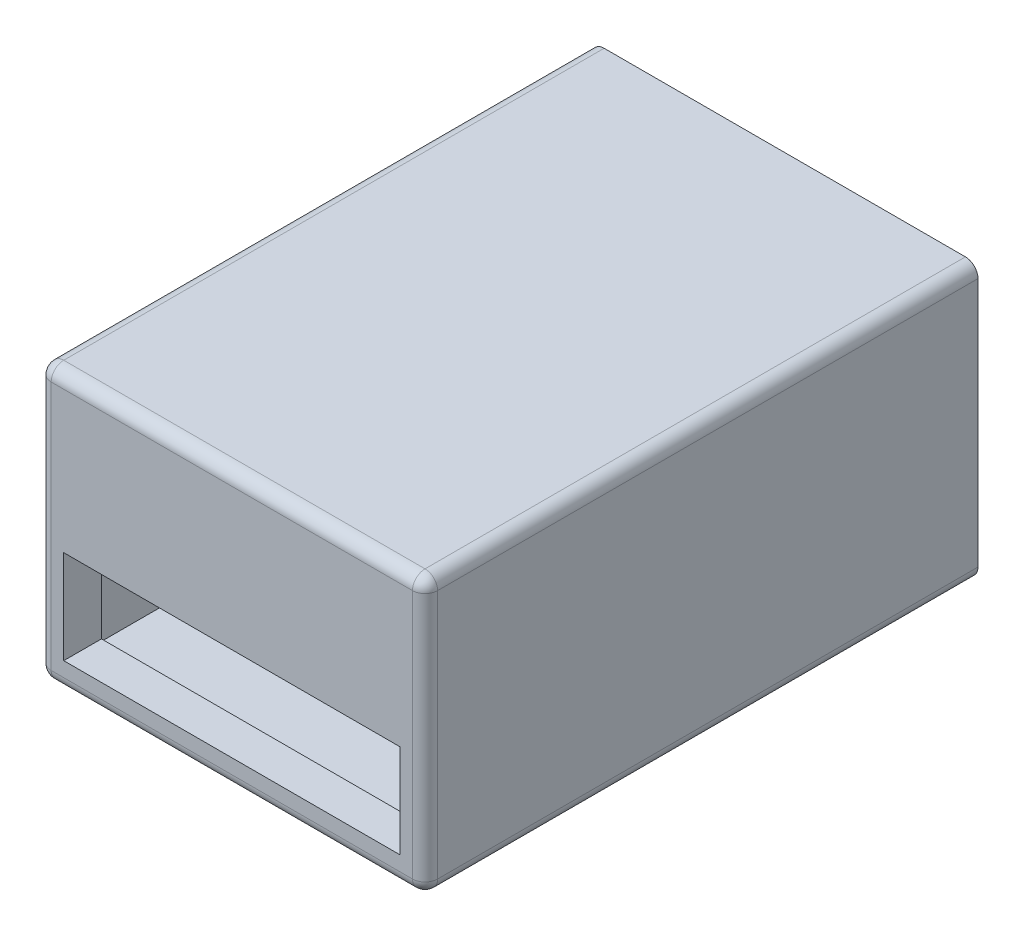
ISO-10303-21;
HEADER;
FILE_DESCRIPTION(('STEP AP214'),'2;1');
FILE_NAME('part.step','',(''),(''),'','','');
FILE_SCHEMA(('AUTOMOTIVE_DESIGN { 1 0 10303 214 1 1 1 1 }'));
ENDSEC;
DATA;
#1=APPLICATION_CONTEXT('core data for automotive mechanical design processes');
#2=APPLICATION_PROTOCOL_DEFINITION('international standard','automotive_design',2000,#1);
#3=PRODUCT_CONTEXT('',#1,'mechanical');
#4=PRODUCT('Part','Part','',(#3));
#5=PRODUCT_RELATED_PRODUCT_CATEGORY('part','',(#4));
#6=PRODUCT_DEFINITION_FORMATION('','',#4);
#7=PRODUCT_DEFINITION_CONTEXT('part definition',#1,'design');
#8=PRODUCT_DEFINITION('design','',#6,#7);
#9=PRODUCT_DEFINITION_SHAPE('','',#8);
#10=(LENGTH_UNIT() NAMED_UNIT(*) SI_UNIT(.MILLI.,.METRE.));
#11=(NAMED_UNIT(*) PLANE_ANGLE_UNIT() SI_UNIT($,.RADIAN.));
#12=(NAMED_UNIT(*) SI_UNIT($,.STERADIAN.) SOLID_ANGLE_UNIT());
#13=UNCERTAINTY_MEASURE_WITH_UNIT(LENGTH_MEASURE(1.E-05),#10,'distance_accuracy_value','');
#14=(GEOMETRIC_REPRESENTATION_CONTEXT(3) GLOBAL_UNCERTAINTY_ASSIGNED_CONTEXT((#13)) GLOBAL_UNIT_ASSIGNED_CONTEXT((#10,
#11,#12)) REPRESENTATION_CONTEXT('',''));
#15=CARTESIAN_POINT('',(0.,0.,0.));
#16=DIRECTION('',(0.,0.,1.));
#17=DIRECTION('',(1.,0.,0.));
#18=AXIS2_PLACEMENT_3D('',#15,#16,#17);
#19=CARTESIAN_POINT('',(0.,0.,88.));
#20=DIRECTION('',(0.,0.,1.));
#21=DIRECTION('',(1.,0.,0.));
#22=AXIS2_PLACEMENT_3D('',#19,#20,#21);
#23=PLANE('',#22);
#24=DIRECTION('',(-1.,0.,0.));
#25=VECTOR('',#24,1.);
#26=CARTESIAN_POINT('',(-31.6005025125628,32.626256281407,88.));
#27=LINE('',#26,#25);
#28=CARTESIAN_POINT('',(27.8994974874372,32.626256281407,88.));
#29=VERTEX_POINT('',#28);
#30=CARTESIAN_POINT('',(-29.6005025125628,32.626256281407,88.));
#31=VERTEX_POINT('',#30);
#32=EDGE_CURVE('E269',#29,#31,#27,.T.);
#33=ORIENTED_EDGE('',*,*,#32,.T.);
#34=DIRECTION('',(0.,-1.,0.));
#35=VECTOR('',#34,1.);
#36=CARTESIAN_POINT('',(-29.6005025125628,-9.12374371859297,88.));
#37=LINE('',#36,#35);
#38=CARTESIAN_POINT('',(-29.6005025125628,-7.12374371859297,88.));
#39=VERTEX_POINT('',#38);
#40=EDGE_CURVE('E275',#31,#39,#37,.T.);
#41=ORIENTED_EDGE('',*,*,#40,.T.);
#42=DIRECTION('',(1.,0.,0.));
#43=VECTOR('',#42,1.);
#44=CARTESIAN_POINT('',(29.8994974874372,-7.12374371859297,88.));
#45=LINE('',#44,#43);
#46=CARTESIAN_POINT('',(27.8994974874372,-7.12374371859297,88.));
#47=VERTEX_POINT('',#46);
#48=EDGE_CURVE('E273',#39,#47,#45,.T.);
#49=ORIENTED_EDGE('',*,*,#48,.T.);
#50=DIRECTION('',(0.,1.,0.));
#51=VECTOR('',#50,1.);
#52=CARTESIAN_POINT('',(27.8994974874372,34.626256281407,88.));
#53=LINE('',#52,#51);
#54=EDGE_CURVE('E271',#47,#29,#53,.T.);
#55=ORIENTED_EDGE('',*,*,#54,.T.);
#56=EDGE_LOOP('',(#33,#41,#49,#55));
#57=FACE_BOUND('',#56,.T.);
#58=DIRECTION('',(1.,0.,0.));
#59=VECTOR('',#58,1.);
#60=CARTESIAN_POINT('',(-27.6005025125628,-4.78162550383576,88.));
#61=LINE('',#60,#59);
#62=CARTESIAN_POINT('',(-27.6005025125628,-4.78162550383576,88.));
#63=VERTEX_POINT('',#62);
#64=CARTESIAN_POINT('',(25.8994974874372,-4.78162550383576,88.));
#65=VERTEX_POINT('',#64);
#66=EDGE_CURVE('E217',#63,#65,#61,.T.);
#67=ORIENTED_EDGE('',*,*,#66,.F.);
#68=DIRECTION('',(0.,1.,0.));
#69=VECTOR('',#68,1.);
#70=CARTESIAN_POINT('',(-27.6005025125628,-4.78162550383576,88.));
#71=LINE('',#70,#69);
#72=CARTESIAN_POINT('',(-27.6005025125628,10.1082239368324,88.));
#73=VERTEX_POINT('',#72);
#74=EDGE_CURVE('E208',#63,#73,#71,.T.);
#75=ORIENTED_EDGE('',*,*,#74,.T.);
#76=DIRECTION('',(1.,0.,0.));
#77=VECTOR('',#76,1.);
#78=CARTESIAN_POINT('',(-27.6005025125628,10.1082239368324,88.));
#79=LINE('',#78,#77);
#80=CARTESIAN_POINT('',(25.8994974874372,10.1082239368324,88.));
#81=VERTEX_POINT('',#80);
#82=EDGE_CURVE('E211',#73,#81,#79,.T.);
#83=ORIENTED_EDGE('',*,*,#82,.T.);
#84=DIRECTION('',(0.,-1.,0.));
#85=VECTOR('',#84,1.);
#86=CARTESIAN_POINT('',(25.8994974874372,10.1082239368324,88.));
#87=LINE('',#86,#85);
#88=EDGE_CURVE('E214',#81,#65,#87,.T.);
#89=ORIENTED_EDGE('',*,*,#88,.T.);
#90=EDGE_LOOP('',(#67,#75,#83,#89));
#91=FACE_BOUND('',#90,.T.);
#92=ADVANCED_FACE('F32',(#57,#91),#23,.T.);
#93=CARTESIAN_POINT('',(0.,0.,0.));
#94=DIRECTION('',(0.,0.,1.));
#95=DIRECTION('',(1.,0.,0.));
#96=AXIS2_PLACEMENT_3D('',#93,#94,#95);
#97=PLANE('',#96);
#98=DIRECTION('',(0.,1.,0.));
#99=VECTOR('',#98,1.);
#100=CARTESIAN_POINT('',(-29.6005025125628,32.626256281407,0.));
#101=LINE('',#100,#99);
#102=CARTESIAN_POINT('',(-29.6005025125628,-7.12374371859297,0.));
#103=VERTEX_POINT('',#102);
#104=CARTESIAN_POINT('',(-29.6005025125628,32.626256281407,0.));
#105=VERTEX_POINT('',#104);
#106=EDGE_CURVE('E192',#103,#105,#101,.T.);
#107=ORIENTED_EDGE('',*,*,#106,.F.);
#108=DIRECTION('',(-1.,0.,0.));
#109=VECTOR('',#108,1.);
#110=CARTESIAN_POINT('',(27.9021455883418,-7.12374371859297,0.));
#111=LINE('',#110,#109);
#112=CARTESIAN_POINT('',(27.9021455883418,-7.12374371859297,0.));
#113=VERTEX_POINT('',#112);
#114=EDGE_CURVE('E163',#113,#103,#111,.T.);
#115=ORIENTED_EDGE('',*,*,#114,.F.);
#116=DIRECTION('',(0.,-1.,0.));
#117=VECTOR('',#116,1.);
#118=CARTESIAN_POINT('',(27.9021455883418,32.626256281407,0.));
#119=LINE('',#118,#117);
#120=CARTESIAN_POINT('',(27.9021455883418,32.626256281407,0.));
#121=VERTEX_POINT('',#120);
#122=EDGE_CURVE('E180',#121,#113,#119,.T.);
#123=ORIENTED_EDGE('',*,*,#122,.F.);
#124=DIRECTION('',(1.,0.,0.));
#125=VECTOR('',#124,1.);
#126=CARTESIAN_POINT('',(27.9021455883418,32.626256281407,0.));
#127=LINE('',#126,#125);
#128=EDGE_CURVE('E183',#105,#121,#127,.T.);
#129=ORIENTED_EDGE('',*,*,#128,.F.);
#130=EDGE_LOOP('',(#107,#115,#123,#129));
#131=FACE_BOUND('',#130,.T.);
#132=DIRECTION('',(0.,-1.,0.));
#133=VECTOR('',#132,1.);
#134=CARTESIAN_POINT('',(-31.6005025125628,34.626256281407,0.));
#135=LINE('',#134,#133);
#136=CARTESIAN_POINT('',(-31.6005025125628,32.626256281407,0.));
#137=VERTEX_POINT('',#136);
#138=CARTESIAN_POINT('',(-31.6005025125628,-7.12374371859296,0.));
#139=VERTEX_POINT('',#138);
#140=EDGE_CURVE('E228',#137,#139,#135,.T.);
#141=ORIENTED_EDGE('',*,*,#140,.F.);
#142=CARTESIAN_POINT('',(-29.6005025125628,32.626256281407,0.));
#143=DIRECTION('',(0.,0.,1.));
#144=DIRECTION('',(1.,0.,0.));
#145=AXIS2_PLACEMENT_3D('',#142,#143,#144);
#146=CIRCLE('',#145,2.);
#147=CARTESIAN_POINT('',(-29.6005025125628,34.626256281407,0.));
#148=VERTEX_POINT('',#147);
#149=EDGE_CURVE('E255',#137,#148,#146,.F.);
#150=ORIENTED_EDGE('',*,*,#149,.T.);
#151=DIRECTION('',(-1.,0.,0.));
#152=VECTOR('',#151,1.);
#153=CARTESIAN_POINT('',(-31.6005025125628,34.626256281407,0.));
#154=LINE('',#153,#152);
#155=CARTESIAN_POINT('',(27.8994974874372,34.626256281407,0.));
#156=VERTEX_POINT('',#155);
#157=EDGE_CURVE('E236',#156,#148,#154,.T.);
#158=ORIENTED_EDGE('',*,*,#157,.F.);
#159=CARTESIAN_POINT('',(27.8994974874372,32.626256281407,0.));
#160=DIRECTION('',(0.,0.,1.));
#161=DIRECTION('',(1.,0.,0.));
#162=AXIS2_PLACEMENT_3D('',#159,#160,#161);
#163=CIRCLE('',#162,2.);
#164=CARTESIAN_POINT('',(29.8994974874372,32.626256281407,0.));
#165=VERTEX_POINT('',#164);
#166=EDGE_CURVE('E249',#156,#165,#163,.F.);
#167=ORIENTED_EDGE('',*,*,#166,.T.);
#168=DIRECTION('',(0.,1.,0.));
#169=VECTOR('',#168,1.);
#170=CARTESIAN_POINT('',(29.8994974874372,34.626256281407,0.));
#171=LINE('',#170,#169);
#172=CARTESIAN_POINT('',(29.8994974874372,-7.12374371859296,0.));
#173=VERTEX_POINT('',#172);
#174=EDGE_CURVE('E234',#173,#165,#171,.T.);
#175=ORIENTED_EDGE('',*,*,#174,.F.);
#176=CARTESIAN_POINT('',(27.8994974874372,-7.12374371859296,0.));
#177=DIRECTION('',(0.,0.,1.));
#178=DIRECTION('',(1.,0.,0.));
#179=AXIS2_PLACEMENT_3D('',#176,#177,#178);
#180=CIRCLE('',#179,2.);
#181=CARTESIAN_POINT('',(27.8994974874372,-9.12374371859297,0.));
#182=VERTEX_POINT('',#181);
#183=EDGE_CURVE('E251',#173,#182,#180,.F.);
#184=ORIENTED_EDGE('',*,*,#183,.T.);
#185=DIRECTION('',(1.,0.,0.));
#186=VECTOR('',#185,1.);
#187=CARTESIAN_POINT('',(-31.6005025125628,-9.12374371859297,0.));
#188=LINE('',#187,#186);
#189=CARTESIAN_POINT('',(-29.6005025125628,-9.12374371859297,0.));
#190=VERTEX_POINT('',#189);
#191=EDGE_CURVE('E231',#190,#182,#188,.T.);
#192=ORIENTED_EDGE('',*,*,#191,.F.);
#193=CARTESIAN_POINT('',(-29.6005025125628,-7.12374371859297,0.));
#194=DIRECTION('',(0.,0.,1.));
#195=DIRECTION('',(1.,0.,0.));
#196=AXIS2_PLACEMENT_3D('',#193,#194,#195);
#197=CIRCLE('',#196,2.);
#198=EDGE_CURVE('E253',#190,#139,#197,.F.);
#199=ORIENTED_EDGE('',*,*,#198,.T.);
#200=EDGE_LOOP('',(#141,#150,#158,#167,#175,#184,#192,#199));
#201=FACE_BOUND('',#200,.T.);
#202=ADVANCED_FACE('F338',(#131,#201),#97,.F.);
#203=CARTESIAN_POINT('',(-31.6005025125628,34.626256281407,88.));
#204=DIRECTION('',(1.,0.,0.));
#205=DIRECTION('',(0.,1.,0.));
#206=AXIS2_PLACEMENT_3D('',#203,#204,#205);
#207=PLANE('',#206);
#208=DIRECTION('',(0.,-1.,0.));
#209=VECTOR('',#208,1.);
#210=CARTESIAN_POINT('',(-31.6005025125628,34.626256281407,86.));
#211=LINE('',#210,#209);
#212=CARTESIAN_POINT('',(-31.6005025125628,-7.12374371859297,86.));
#213=VERTEX_POINT('',#212);
#214=CARTESIAN_POINT('',(-31.6005025125628,32.626256281407,86.));
#215=VERTEX_POINT('',#214);
#216=EDGE_CURVE('E242',#213,#215,#211,.F.);
#217=ORIENTED_EDGE('',*,*,#216,.T.);
#218=DIRECTION('',(0.,0.,-1.));
#219=VECTOR('',#218,1.);
#220=CARTESIAN_POINT('',(-31.6005025125628,32.626256281407,88.));
#221=LINE('',#220,#219);
#222=EDGE_CURVE('E246',#215,#137,#221,.T.);
#223=ORIENTED_EDGE('',*,*,#222,.T.);
#224=ORIENTED_EDGE('',*,*,#140,.T.);
#225=DIRECTION('',(0.,0.,-1.));
#226=VECTOR('',#225,1.);
#227=CARTESIAN_POINT('',(-31.6005025125628,-7.12374371859296,88.));
#228=LINE('',#227,#226);
#229=EDGE_CURVE('E244',#139,#213,#228,.F.);
#230=ORIENTED_EDGE('',*,*,#229,.T.);
#231=EDGE_LOOP('',(#217,#223,#224,#230));
#232=FACE_BOUND('',#231,.T.);
#233=ADVANCED_FACE('F344',(#232),#207,.F.);
#234=CARTESIAN_POINT('',(-31.6005025125628,-9.12374371859297,88.));
#235=DIRECTION('',(0.,1.,0.));
#236=DIRECTION('',(0.,0.,1.));
#237=AXIS2_PLACEMENT_3D('',#234,#235,#236);
#238=PLANE('',#237);
#239=DIRECTION('',(1.,0.,0.));
#240=VECTOR('',#239,1.);
#241=CARTESIAN_POINT('',(-31.6005025125628,-9.12374371859297,86.));
#242=LINE('',#241,#240);
#243=CARTESIAN_POINT('',(27.8994974874372,-9.12374371859297,86.));
#244=VERTEX_POINT('',#243);
#245=CARTESIAN_POINT('',(-29.6005025125628,-9.12374371859297,86.));
#246=VERTEX_POINT('',#245);
#247=EDGE_CURVE('E265',#244,#246,#242,.F.);
#248=ORIENTED_EDGE('',*,*,#247,.T.);
#249=DIRECTION('',(0.,0.,-1.));
#250=VECTOR('',#249,1.);
#251=CARTESIAN_POINT('',(-29.6005025125628,-9.12374371859297,88.));
#252=LINE('',#251,#250);
#253=EDGE_CURVE('E267',#246,#190,#252,.T.);
#254=ORIENTED_EDGE('',*,*,#253,.T.);
#255=ORIENTED_EDGE('',*,*,#191,.T.);
#256=DIRECTION('',(0.,0.,-1.));
#257=VECTOR('',#256,1.);
#258=CARTESIAN_POINT('',(27.8994974874372,-9.12374371859297,88.));
#259=LINE('',#258,#257);
#260=EDGE_CURVE('E263',#182,#244,#259,.F.);
#261=ORIENTED_EDGE('',*,*,#260,.T.);
#262=EDGE_LOOP('',(#248,#254,#255,#261));
#263=FACE_BOUND('',#262,.T.);
#264=ADVANCED_FACE('F359',(#263),#238,.F.);
#265=CARTESIAN_POINT('',(29.8994974874372,34.626256281407,88.));
#266=DIRECTION('',(-1.,0.,0.));
#267=DIRECTION('',(0.,0.,1.));
#268=AXIS2_PLACEMENT_3D('',#265,#266,#267);
#269=PLANE('',#268);
#270=DIRECTION('',(0.,1.,0.));
#271=VECTOR('',#270,1.);
#272=CARTESIAN_POINT('',(29.8994974874372,-9.12374371859297,86.));
#273=LINE('',#272,#271);
#274=CARTESIAN_POINT('',(29.8994974874372,32.626256281407,86.));
#275=VERTEX_POINT('',#274);
#276=CARTESIAN_POINT('',(29.8994974874372,-7.12374371859296,86.));
#277=VERTEX_POINT('',#276);
#278=EDGE_CURVE('E47',#275,#277,#273,.F.);
#279=ORIENTED_EDGE('',*,*,#278,.T.);
#280=DIRECTION('',(0.,0.,-1.));
#281=VECTOR('',#280,1.);
#282=CARTESIAN_POINT('',(29.8994974874372,-7.12374371859296,88.));
#283=LINE('',#282,#281);
#284=EDGE_CURVE('E280',#277,#173,#283,.T.);
#285=ORIENTED_EDGE('',*,*,#284,.T.);
#286=ORIENTED_EDGE('',*,*,#174,.T.);
#287=DIRECTION('',(0.,0.,-1.));
#288=VECTOR('',#287,1.);
#289=CARTESIAN_POINT('',(29.8994974874372,32.626256281407,88.));
#290=LINE('',#289,#288);
#291=EDGE_CURVE('E52',#165,#275,#290,.F.);
#292=ORIENTED_EDGE('',*,*,#291,.T.);
#293=EDGE_LOOP('',(#279,#285,#286,#292));
#294=FACE_BOUND('',#293,.T.);
#295=ADVANCED_FACE('F355',(#294),#269,.F.);
#296=CARTESIAN_POINT('',(-31.6005025125628,34.626256281407,88.));
#297=DIRECTION('',(0.,-1.,0.));
#298=DIRECTION('',(0.,0.,-1.));
#299=AXIS2_PLACEMENT_3D('',#296,#297,#298);
#300=PLANE('',#299);
#301=ORIENTED_EDGE('',*,*,#157,.T.);
#302=DIRECTION('',(0.,0.,-1.));
#303=VECTOR('',#302,1.);
#304=CARTESIAN_POINT('',(-29.6005025125628,34.626256281407,88.));
#305=LINE('',#304,#303);
#306=CARTESIAN_POINT('',(-29.6005025125628,34.626256281407,86.));
#307=VERTEX_POINT('',#306);
#308=EDGE_CURVE('E261',#148,#307,#305,.F.);
#309=ORIENTED_EDGE('',*,*,#308,.T.);
#310=DIRECTION('',(-1.,0.,0.));
#311=VECTOR('',#310,1.);
#312=CARTESIAN_POINT('',(29.8994974874372,34.626256281407,86.));
#313=LINE('',#312,#311);
#314=CARTESIAN_POINT('',(27.8994974874372,34.626256281407,86.));
#315=VERTEX_POINT('',#314);
#316=EDGE_CURVE('E259',#307,#315,#313,.F.);
#317=ORIENTED_EDGE('',*,*,#316,.T.);
#318=DIRECTION('',(0.,0.,-1.));
#319=VECTOR('',#318,1.);
#320=CARTESIAN_POINT('',(27.8994974874372,34.626256281407,88.));
#321=LINE('',#320,#319);
#322=EDGE_CURVE('E257',#315,#156,#321,.T.);
#323=ORIENTED_EDGE('',*,*,#322,.T.);
#324=EDGE_LOOP('',(#301,#309,#317,#323));
#325=FACE_BOUND('',#324,.T.);
#326=ADVANCED_FACE('F352',(#325),#300,.F.);
#327=CARTESIAN_POINT('',(-27.6005025125628,-4.78162550383576,-0.001000000000001));
#328=DIRECTION('',(1.,0.,0.));
#329=DIRECTION('',(0.,0.,-1.));
#330=AXIS2_PLACEMENT_3D('',#327,#328,#329);
#331=PLANE('',#330);
#332=DIRECTION('',(0.,-1.,0.));
#333=VECTOR('',#332,1.);
#334=CARTESIAN_POINT('',(-27.6005025125628,-4.78162550383576,82.));
#335=LINE('',#334,#333);
#336=CARTESIAN_POINT('',(-27.6005025125628,10.1082239368324,82.));
#337=VERTEX_POINT('',#336);
#338=CARTESIAN_POINT('',(-27.6005025125628,-4.78162550383576,82.));
#339=VERTEX_POINT('',#338);
#340=EDGE_CURVE('E206',#337,#339,#335,.T.);
#341=ORIENTED_EDGE('',*,*,#340,.F.);
#342=DIRECTION('',(0.,0.,1.));
#343=VECTOR('',#342,1.);
#344=CARTESIAN_POINT('',(-27.6005025125628,10.1082239368324,-0.001000000000001));
#345=LINE('',#344,#343);
#346=EDGE_CURVE('E226',#337,#73,#345,.T.);
#347=ORIENTED_EDGE('',*,*,#346,.T.);
#348=ORIENTED_EDGE('',*,*,#74,.F.);
#349=DIRECTION('',(0.,0.,1.));
#350=VECTOR('',#349,1.);
#351=CARTESIAN_POINT('',(-27.6005025125628,-4.78162550383576,-0.001000000000001));
#352=LINE('',#351,#350);
#353=EDGE_CURVE('E220',#339,#63,#352,.T.);
#354=ORIENTED_EDGE('',*,*,#353,.F.);
#355=EDGE_LOOP('',(#341,#347,#348,#354));
#356=FACE_BOUND('',#355,.T.);
#357=ADVANCED_FACE('F349',(#356),#331,.T.);
#358=CARTESIAN_POINT('',(-27.6005025125628,10.1082239368324,-0.001000000000001));
#359=DIRECTION('',(0.,-1.,0.));
#360=DIRECTION('',(0.,0.,-1.));
#361=AXIS2_PLACEMENT_3D('',#358,#359,#360);
#362=PLANE('',#361);
#363=DIRECTION('',(-1.,0.,0.));
#364=VECTOR('',#363,1.);
#365=CARTESIAN_POINT('',(-27.6005025125628,10.1082239368324,82.));
#366=LINE('',#365,#364);
#367=CARTESIAN_POINT('',(25.8994974874372,10.1082239368324,82.));
#368=VERTEX_POINT('',#367);
#369=EDGE_CURVE('E204',#368,#337,#366,.T.);
#370=ORIENTED_EDGE('',*,*,#369,.F.);
#371=DIRECTION('',(0.,0.,1.));
#372=VECTOR('',#371,1.);
#373=CARTESIAN_POINT('',(25.8994974874372,10.1082239368324,-0.001000000000001));
#374=LINE('',#373,#372);
#375=EDGE_CURVE('E224',#368,#81,#374,.T.);
#376=ORIENTED_EDGE('',*,*,#375,.T.);
#377=ORIENTED_EDGE('',*,*,#82,.F.);
#378=ORIENTED_EDGE('',*,*,#346,.F.);
#379=EDGE_LOOP('',(#370,#376,#377,#378));
#380=FACE_BOUND('',#379,.T.);
#381=ADVANCED_FACE('F644',(#380),#362,.T.);
#382=CARTESIAN_POINT('',(25.8994974874372,10.1082239368324,-0.001000000000001));
#383=DIRECTION('',(-1.,0.,0.));
#384=DIRECTION('',(0.,0.,1.));
#385=AXIS2_PLACEMENT_3D('',#382,#383,#384);
#386=PLANE('',#385);
#387=DIRECTION('',(0.,1.,0.));
#388=VECTOR('',#387,1.);
#389=CARTESIAN_POINT('',(25.8994974874372,10.1082239368324,82.));
#390=LINE('',#389,#388);
#391=CARTESIAN_POINT('',(25.8994974874372,-4.78162550383576,82.));
#392=VERTEX_POINT('',#391);
#393=EDGE_CURVE('E199',#392,#368,#390,.T.);
#394=ORIENTED_EDGE('',*,*,#393,.F.);
#395=DIRECTION('',(0.,0.,1.));
#396=VECTOR('',#395,1.);
#397=CARTESIAN_POINT('',(25.8994974874372,-4.78162550383576,-0.001000000000001));
#398=LINE('',#397,#396);
#399=EDGE_CURVE('E222',#392,#65,#398,.T.);
#400=ORIENTED_EDGE('',*,*,#399,.T.);
#401=ORIENTED_EDGE('',*,*,#88,.F.);
#402=ORIENTED_EDGE('',*,*,#375,.F.);
#403=EDGE_LOOP('',(#394,#400,#401,#402));
#404=FACE_BOUND('',#403,.T.);
#405=ADVANCED_FACE('F332',(#404),#386,.T.);
#406=CARTESIAN_POINT('',(-27.6005025125628,-4.78162550383576,-0.001000000000001));
#407=DIRECTION('',(0.,-1.,0.));
#408=DIRECTION('',(0.,0.,-1.));
#409=AXIS2_PLACEMENT_3D('',#406,#407,#408);
#410=PLANE('',#409);
#411=ORIENTED_EDGE('',*,*,#399,.F.);
#412=DIRECTION('',(-1.,0.,0.));
#413=VECTOR('',#412,1.);
#414=CARTESIAN_POINT('',(-27.6005025125628,-4.78162550383576,82.));
#415=LINE('',#414,#413);
#416=EDGE_CURVE('E239',#392,#339,#415,.T.);
#417=ORIENTED_EDGE('',*,*,#416,.T.);
#418=ORIENTED_EDGE('',*,*,#353,.T.);
#419=ORIENTED_EDGE('',*,*,#66,.T.);
#420=EDGE_LOOP('',(#411,#417,#418,#419));
#421=FACE_BOUND('',#420,.T.);
#422=ADVANCED_FACE('F322',(#421),#410,.F.);
#423=CARTESIAN_POINT('',(27.9021455883418,-7.12374371859297,82.));
#424=DIRECTION('',(0.,-1.,0.));
#425=DIRECTION('',(0.,0.,-1.));
#426=AXIS2_PLACEMENT_3D('',#423,#424,#425);
#427=PLANE('',#426);
#428=CARTESIAN_POINT('',(-9.85050251256282,-7.12374371859297,9.49999999999999));
#429=DIRECTION('',(0.,-1.,0.));
#430=DIRECTION('',(0.,0.,-1.));
#431=AXIS2_PLACEMENT_3D('',#428,#429,#430);
#432=CIRCLE('',#431,1.5);
#433=CARTESIAN_POINT('',(-9.85050251256282,-7.12374371859297,7.99999999999999));
#434=VERTEX_POINT('',#433);
#435=EDGE_CURVE('E11',#434,#434,#432,.F.);
#436=ORIENTED_EDGE('',*,*,#435,.F.);
#437=EDGE_LOOP('',(#436));
#438=FACE_BOUND('',#437,.T.);
#439=CARTESIAN_POINT('',(18.0021455883418,-7.12374371859297,9.40000000000001));
#440=DIRECTION('',(0.,-1.,0.));
#441=DIRECTION('',(0.,0.,-1.));
#442=AXIS2_PLACEMENT_3D('',#439,#440,#441);
#443=CIRCLE('',#442,1.5);
#444=CARTESIAN_POINT('',(18.0021455883418,-7.12374371859297,7.9));
#445=VERTEX_POINT('',#444);
#446=EDGE_CURVE('E40',#445,#445,#443,.F.);
#447=ORIENTED_EDGE('',*,*,#446,.F.);
#448=EDGE_LOOP('',(#447));
#449=FACE_BOUND('',#448,.T.);
#450=ORIENTED_EDGE('',*,*,#114,.T.);
#451=DIRECTION('',(0.,0.,-1.));
#452=VECTOR('',#451,1.);
#453=CARTESIAN_POINT('',(-29.6005025125628,-7.12374371859297,82.));
#454=LINE('',#453,#452);
#455=CARTESIAN_POINT('',(-29.6005025125628,-7.12374371859297,82.));
#456=VERTEX_POINT('',#455);
#457=EDGE_CURVE('E156',#456,#103,#454,.T.);
#458=ORIENTED_EDGE('',*,*,#457,.F.);
#459=DIRECTION('',(-1.,0.,0.));
#460=VECTOR('',#459,1.);
#461=CARTESIAN_POINT('',(27.9021455883418,-7.12374371859297,82.));
#462=LINE('',#461,#460);
#463=CARTESIAN_POINT('',(27.9021455883418,-7.12374371859297,82.));
#464=VERTEX_POINT('',#463);
#465=EDGE_CURVE('E160',#464,#456,#462,.T.);
#466=ORIENTED_EDGE('',*,*,#465,.F.);
#467=DIRECTION('',(0.,0.,-1.));
#468=VECTOR('',#467,1.);
#469=CARTESIAN_POINT('',(27.9021455883418,-7.12374371859297,82.));
#470=LINE('',#469,#468);
#471=EDGE_CURVE('E197',#464,#113,#470,.T.);
#472=ORIENTED_EDGE('',*,*,#471,.T.);
#473=EDGE_LOOP('',(#450,#458,#466,#472));
#474=FACE_BOUND('',#473,.T.);
#475=ADVANCED_FACE('F158',(#438,#449,#474),#427,.F.);
#476=CARTESIAN_POINT('',(27.9021455883418,32.626256281407,82.));
#477=DIRECTION('',(1.,0.,0.));
#478=DIRECTION('',(0.,0.,-1.));
#479=AXIS2_PLACEMENT_3D('',#476,#477,#478);
#480=PLANE('',#479);
#481=ORIENTED_EDGE('',*,*,#122,.T.);
#482=ORIENTED_EDGE('',*,*,#471,.F.);
#483=DIRECTION('',(0.,-1.,0.));
#484=VECTOR('',#483,1.);
#485=CARTESIAN_POINT('',(27.9021455883418,32.626256281407,82.));
#486=LINE('',#485,#484);
#487=CARTESIAN_POINT('',(27.9021455883418,32.626256281407,82.));
#488=VERTEX_POINT('',#487);
#489=EDGE_CURVE('E168',#488,#464,#486,.T.);
#490=ORIENTED_EDGE('',*,*,#489,.F.);
#491=DIRECTION('',(0.,0.,-1.));
#492=VECTOR('',#491,1.);
#493=CARTESIAN_POINT('',(27.9021455883418,32.626256281407,82.));
#494=LINE('',#493,#492);
#495=EDGE_CURVE('E200',#488,#121,#494,.T.);
#496=ORIENTED_EDGE('',*,*,#495,.T.);
#497=EDGE_LOOP('',(#481,#482,#490,#496));
#498=FACE_BOUND('',#497,.T.);
#499=ADVANCED_FACE('F321',(#498),#480,.F.);
#500=CARTESIAN_POINT('',(27.9021455883418,32.626256281407,82.));
#501=DIRECTION('',(0.,1.,0.));
#502=DIRECTION('',(0.,0.,1.));
#503=AXIS2_PLACEMENT_3D('',#500,#501,#502);
#504=PLANE('',#503);
#505=ORIENTED_EDGE('',*,*,#128,.T.);
#506=ORIENTED_EDGE('',*,*,#495,.F.);
#507=DIRECTION('',(1.,0.,0.));
#508=VECTOR('',#507,1.);
#509=CARTESIAN_POINT('',(27.9021455883418,32.626256281407,82.));
#510=LINE('',#509,#508);
#511=CARTESIAN_POINT('',(-29.6005025125628,32.626256281407,82.));
#512=VERTEX_POINT('',#511);
#513=EDGE_CURVE('E176',#512,#488,#510,.T.);
#514=ORIENTED_EDGE('',*,*,#513,.F.);
#515=DIRECTION('',(0.,0.,-1.));
#516=VECTOR('',#515,1.);
#517=CARTESIAN_POINT('',(-29.6005025125628,32.626256281407,82.));
#518=LINE('',#517,#516);
#519=EDGE_CURVE('E167',#512,#105,#518,.T.);
#520=ORIENTED_EDGE('',*,*,#519,.T.);
#521=EDGE_LOOP('',(#505,#506,#514,#520));
#522=FACE_BOUND('',#521,.T.);
#523=ADVANCED_FACE('F329',(#522),#504,.F.);
#524=CARTESIAN_POINT('',(-29.6005025125628,32.626256281407,82.));
#525=DIRECTION('',(-1.,0.,0.));
#526=DIRECTION('',(0.,-1.,0.));
#527=AXIS2_PLACEMENT_3D('',#524,#525,#526);
#528=PLANE('',#527);
#529=ORIENTED_EDGE('',*,*,#106,.T.);
#530=ORIENTED_EDGE('',*,*,#519,.F.);
#531=DIRECTION('',(0.,1.,0.));
#532=VECTOR('',#531,1.);
#533=CARTESIAN_POINT('',(-29.6005025125628,32.626256281407,82.));
#534=LINE('',#533,#532);
#535=EDGE_CURVE('E171',#456,#512,#534,.T.);
#536=ORIENTED_EDGE('',*,*,#535,.F.);
#537=ORIENTED_EDGE('',*,*,#457,.T.);
#538=EDGE_LOOP('',(#529,#530,#536,#537));
#539=FACE_BOUND('',#538,.T.);
#540=ADVANCED_FACE('F172',(#539),#528,.F.);
#541=CARTESIAN_POINT('',(0.,0.,82.));
#542=DIRECTION('',(0.,0.,1.));
#543=DIRECTION('',(1.,0.,0.));
#544=AXIS2_PLACEMENT_3D('',#541,#542,#543);
#545=PLANE('',#544);
#546=ORIENTED_EDGE('',*,*,#340,.T.);
#547=ORIENTED_EDGE('',*,*,#416,.F.);
#548=ORIENTED_EDGE('',*,*,#393,.T.);
#549=ORIENTED_EDGE('',*,*,#369,.T.);
#550=EDGE_LOOP('',(#546,#547,#548,#549));
#551=FACE_BOUND('',#550,.T.);
#552=ORIENTED_EDGE('',*,*,#465,.T.);
#553=ORIENTED_EDGE('',*,*,#535,.T.);
#554=ORIENTED_EDGE('',*,*,#513,.T.);
#555=ORIENTED_EDGE('',*,*,#489,.T.);
#556=EDGE_LOOP('',(#552,#553,#554,#555));
#557=FACE_BOUND('',#556,.T.);
#558=ADVANCED_FACE('F178',(#551,#557),#545,.F.);
#559=CARTESIAN_POINT('',(27.8994974874372,-7.12374371859296,88.));
#560=DIRECTION('',(0.,0.,-1.));
#561=DIRECTION('',(-1.,0.,0.));
#562=AXIS2_PLACEMENT_3D('',#559,#560,#561);
#563=CYLINDRICAL_SURFACE('',#562,2.);
#564=CARTESIAN_POINT('',(27.8994974874372,-7.12374371859297,86.));
#565=DIRECTION('',(0.,0.,1.));
#566=DIRECTION('',(1.,0.,0.));
#567=AXIS2_PLACEMENT_3D('',#564,#565,#566);
#568=CIRCLE('',#567,2.);
#569=EDGE_CURVE('E193',#244,#277,#568,.T.);
#570=ORIENTED_EDGE('',*,*,#569,.F.);
#571=ORIENTED_EDGE('',*,*,#260,.F.);
#572=ORIENTED_EDGE('',*,*,#183,.F.);
#573=ORIENTED_EDGE('',*,*,#284,.F.);
#574=EDGE_LOOP('',(#570,#571,#572,#573));
#575=FACE_BOUND('',#574,.T.);
#576=ADVANCED_FACE('F34',(#575),#563,.T.);
#577=CARTESIAN_POINT('',(27.8994974874372,-7.12374371859297,86.));
#578=DIRECTION('',(0.,0.,1.));
#579=DIRECTION('',(1.,0.,0.));
#580=AXIS2_PLACEMENT_3D('',#577,#578,#579);
#581=SPHERICAL_SURFACE('',#580,2.);
#582=CARTESIAN_POINT('',(27.8994974874372,-7.12374371859297,86.));
#583=DIRECTION('',(1.,0.,0.));
#584=DIRECTION('',(0.,0.,-1.));
#585=AXIS2_PLACEMENT_3D('',#582,#583,#584);
#586=CIRCLE('',#585,2.);
#587=EDGE_CURVE('E308',#244,#47,#586,.F.);
#588=ORIENTED_EDGE('',*,*,#587,.F.);
#589=ORIENTED_EDGE('',*,*,#569,.T.);
#590=CARTESIAN_POINT('',(27.8994974874372,-7.12374371859296,86.));
#591=DIRECTION('',(0.,-1.,0.));
#592=DIRECTION('',(0.,0.,-1.));
#593=AXIS2_PLACEMENT_3D('',#590,#591,#592);
#594=CIRCLE('',#593,2.);
#595=EDGE_CURVE('E311',#47,#277,#594,.F.);
#596=ORIENTED_EDGE('',*,*,#595,.F.);
#597=EDGE_LOOP('',(#588,#589,#596));
#598=FACE_BOUND('',#597,.T.);
#599=ADVANCED_FACE('F404',(#598),#581,.T.);
#600=CARTESIAN_POINT('',(27.8994974874372,32.626256281407,88.));
#601=DIRECTION('',(0.,0.,-1.));
#602=DIRECTION('',(-1.,0.,0.));
#603=AXIS2_PLACEMENT_3D('',#600,#601,#602);
#604=CYLINDRICAL_SURFACE('',#603,2.);
#605=ORIENTED_EDGE('',*,*,#166,.F.);
#606=ORIENTED_EDGE('',*,*,#322,.F.);
#607=CARTESIAN_POINT('',(27.8994974874372,32.626256281407,86.));
#608=DIRECTION('',(0.,0.,1.));
#609=DIRECTION('',(1.,0.,0.));
#610=AXIS2_PLACEMENT_3D('',#607,#608,#609);
#611=CIRCLE('',#610,2.);
#612=EDGE_CURVE('E305',#275,#315,#611,.T.);
#613=ORIENTED_EDGE('',*,*,#612,.F.);
#614=ORIENTED_EDGE('',*,*,#291,.F.);
#615=EDGE_LOOP('',(#605,#606,#613,#614));
#616=FACE_BOUND('',#615,.T.);
#617=ADVANCED_FACE('F401',(#616),#604,.T.);
#618=CARTESIAN_POINT('',(27.8994974874372,0.,86.));
#619=DIRECTION('',(0.,-1.,0.));
#620=DIRECTION('',(0.,0.,-1.));
#621=AXIS2_PLACEMENT_3D('',#618,#619,#620);
#622=CYLINDRICAL_SURFACE('',#621,2.);
#623=ORIENTED_EDGE('',*,*,#595,.T.);
#624=ORIENTED_EDGE('',*,*,#278,.F.);
#625=CARTESIAN_POINT('',(27.8994974874372,32.626256281407,86.));
#626=DIRECTION('',(0.,1.,0.));
#627=DIRECTION('',(0.,0.,1.));
#628=AXIS2_PLACEMENT_3D('',#625,#626,#627);
#629=CIRCLE('',#628,2.);
#630=EDGE_CURVE('E302',#29,#275,#629,.T.);
#631=ORIENTED_EDGE('',*,*,#630,.F.);
#632=ORIENTED_EDGE('',*,*,#54,.F.);
#633=EDGE_LOOP('',(#623,#624,#631,#632));
#634=FACE_BOUND('',#633,.T.);
#635=ADVANCED_FACE('F397',(#634),#622,.T.);
#636=CARTESIAN_POINT('',(0.,-7.12374371859297,86.));
#637=DIRECTION('',(-1.,0.,0.));
#638=DIRECTION('',(0.,0.,1.));
#639=AXIS2_PLACEMENT_3D('',#636,#637,#638);
#640=CYLINDRICAL_SURFACE('',#639,2.);
#641=ORIENTED_EDGE('',*,*,#587,.T.);
#642=ORIENTED_EDGE('',*,*,#48,.F.);
#643=CARTESIAN_POINT('',(-29.6005025125628,-7.12374371859297,86.));
#644=DIRECTION('',(-1.,0.,0.));
#645=DIRECTION('',(0.,0.,1.));
#646=AXIS2_PLACEMENT_3D('',#643,#644,#645);
#647=CIRCLE('',#646,2.);
#648=EDGE_CURVE('E299',#246,#39,#647,.T.);
#649=ORIENTED_EDGE('',*,*,#648,.F.);
#650=ORIENTED_EDGE('',*,*,#247,.F.);
#651=EDGE_LOOP('',(#641,#642,#649,#650));
#652=FACE_BOUND('',#651,.T.);
#653=ADVANCED_FACE('F393',(#652),#640,.T.);
#654=CARTESIAN_POINT('',(-29.6005025125628,-7.12374371859297,88.));
#655=DIRECTION('',(0.,0.,-1.));
#656=DIRECTION('',(-1.,0.,0.));
#657=AXIS2_PLACEMENT_3D('',#654,#655,#656);
#658=CYLINDRICAL_SURFACE('',#657,2.);
#659=ORIENTED_EDGE('',*,*,#198,.F.);
#660=ORIENTED_EDGE('',*,*,#253,.F.);
#661=CARTESIAN_POINT('',(-29.6005025125628,-7.12374371859297,86.));
#662=DIRECTION('',(0.,0.,1.));
#663=DIRECTION('',(1.,0.,0.));
#664=AXIS2_PLACEMENT_3D('',#661,#662,#663);
#665=CIRCLE('',#664,2.);
#666=EDGE_CURVE('E296',#213,#246,#665,.T.);
#667=ORIENTED_EDGE('',*,*,#666,.F.);
#668=ORIENTED_EDGE('',*,*,#229,.F.);
#669=EDGE_LOOP('',(#659,#660,#667,#668));
#670=FACE_BOUND('',#669,.T.);
#671=ADVANCED_FACE('F389',(#670),#658,.T.);
#672=CARTESIAN_POINT('',(27.8994974874372,32.626256281407,86.));
#673=DIRECTION('',(0.,0.,1.));
#674=DIRECTION('',(1.,0.,0.));
#675=AXIS2_PLACEMENT_3D('',#672,#673,#674);
#676=SPHERICAL_SURFACE('',#675,2.);
#677=ORIENTED_EDGE('',*,*,#630,.T.);
#678=ORIENTED_EDGE('',*,*,#612,.T.);
#679=CARTESIAN_POINT('',(27.8994974874372,32.626256281407,86.));
#680=DIRECTION('',(1.,0.,0.));
#681=DIRECTION('',(0.,0.,-1.));
#682=AXIS2_PLACEMENT_3D('',#679,#680,#681);
#683=CIRCLE('',#682,2.);
#684=EDGE_CURVE('E293',#29,#315,#683,.F.);
#685=ORIENTED_EDGE('',*,*,#684,.F.);
#686=EDGE_LOOP('',(#677,#678,#685));
#687=FACE_BOUND('',#686,.T.);
#688=ADVANCED_FACE('F385',(#687),#676,.T.);
#689=CARTESIAN_POINT('',(-29.6005025125628,-7.12374371859297,86.));
#690=DIRECTION('',(0.,0.,1.));
#691=DIRECTION('',(1.,0.,0.));
#692=AXIS2_PLACEMENT_3D('',#689,#690,#691);
#693=SPHERICAL_SURFACE('',#692,2.);
#694=ORIENTED_EDGE('',*,*,#666,.T.);
#695=ORIENTED_EDGE('',*,*,#648,.T.);
#696=CARTESIAN_POINT('',(-29.6005025125628,-7.12374371859297,86.));
#697=DIRECTION('',(0.,-1.,0.));
#698=DIRECTION('',(0.,0.,-1.));
#699=AXIS2_PLACEMENT_3D('',#696,#697,#698);
#700=CIRCLE('',#699,2.);
#701=EDGE_CURVE('E291',#213,#39,#700,.F.);
#702=ORIENTED_EDGE('',*,*,#701,.F.);
#703=EDGE_LOOP('',(#694,#695,#702));
#704=FACE_BOUND('',#703,.T.);
#705=ADVANCED_FACE('F381',(#704),#693,.T.);
#706=CARTESIAN_POINT('',(0.,32.626256281407,86.));
#707=DIRECTION('',(1.,0.,0.));
#708=DIRECTION('',(0.,0.,-1.));
#709=AXIS2_PLACEMENT_3D('',#706,#707,#708);
#710=CYLINDRICAL_SURFACE('',#709,2.);
#711=ORIENTED_EDGE('',*,*,#684,.T.);
#712=ORIENTED_EDGE('',*,*,#316,.F.);
#713=CARTESIAN_POINT('',(-29.6005025125628,32.626256281407,86.));
#714=DIRECTION('',(-1.,0.,0.));
#715=DIRECTION('',(0.,0.,1.));
#716=AXIS2_PLACEMENT_3D('',#713,#714,#715);
#717=CIRCLE('',#716,2.);
#718=EDGE_CURVE('E288',#31,#307,#717,.T.);
#719=ORIENTED_EDGE('',*,*,#718,.F.);
#720=ORIENTED_EDGE('',*,*,#32,.F.);
#721=EDGE_LOOP('',(#711,#712,#719,#720));
#722=FACE_BOUND('',#721,.T.);
#723=ADVANCED_FACE('F377',(#722),#710,.T.);
#724=CARTESIAN_POINT('',(-29.6005025125628,0.,86.));
#725=DIRECTION('',(0.,1.,0.));
#726=DIRECTION('',(-1.,0.,0.));
#727=AXIS2_PLACEMENT_3D('',#724,#725,#726);
#728=CYLINDRICAL_SURFACE('',#727,2.);
#729=ORIENTED_EDGE('',*,*,#701,.T.);
#730=ORIENTED_EDGE('',*,*,#40,.F.);
#731=CARTESIAN_POINT('',(-29.6005025125628,32.626256281407,86.));
#732=DIRECTION('',(0.,1.,0.));
#733=DIRECTION('',(0.,0.,1.));
#734=AXIS2_PLACEMENT_3D('',#731,#732,#733);
#735=CIRCLE('',#734,2.);
#736=EDGE_CURVE('E285',#215,#31,#735,.T.);
#737=ORIENTED_EDGE('',*,*,#736,.F.);
#738=ORIENTED_EDGE('',*,*,#216,.F.);
#739=EDGE_LOOP('',(#729,#730,#737,#738));
#740=FACE_BOUND('',#739,.T.);
#741=ADVANCED_FACE('F373',(#740),#728,.T.);
#742=CARTESIAN_POINT('',(-29.6005025125628,32.626256281407,86.));
#743=DIRECTION('',(0.,0.,1.));
#744=DIRECTION('',(1.,0.,0.));
#745=AXIS2_PLACEMENT_3D('',#742,#743,#744);
#746=SPHERICAL_SURFACE('',#745,2.);
#747=ORIENTED_EDGE('',*,*,#736,.T.);
#748=ORIENTED_EDGE('',*,*,#718,.T.);
#749=CARTESIAN_POINT('',(-29.6005025125628,32.626256281407,86.));
#750=DIRECTION('',(0.,0.,1.));
#751=DIRECTION('',(1.,0.,0.));
#752=AXIS2_PLACEMENT_3D('',#749,#750,#751);
#753=CIRCLE('',#752,2.);
#754=EDGE_CURVE('E282',#215,#307,#753,.F.);
#755=ORIENTED_EDGE('',*,*,#754,.F.);
#756=EDGE_LOOP('',(#747,#748,#755));
#757=FACE_BOUND('',#756,.T.);
#758=ADVANCED_FACE('F369',(#757),#746,.T.);
#759=CARTESIAN_POINT('',(-29.6005025125628,32.626256281407,88.));
#760=DIRECTION('',(0.,0.,-1.));
#761=DIRECTION('',(-1.,0.,0.));
#762=AXIS2_PLACEMENT_3D('',#759,#760,#761);
#763=CYLINDRICAL_SURFACE('',#762,2.);
#764=ORIENTED_EDGE('',*,*,#754,.T.);
#765=ORIENTED_EDGE('',*,*,#308,.F.);
#766=ORIENTED_EDGE('',*,*,#149,.F.);
#767=ORIENTED_EDGE('',*,*,#222,.F.);
#768=EDGE_LOOP('',(#764,#765,#766,#767));
#769=FACE_BOUND('',#768,.T.);
#770=ADVANCED_FACE('F366',(#769),#763,.T.);
#771=CARTESIAN_POINT('',(18.0021455883418,-1.92374371859297,9.40000000000001));
#772=DIRECTION('',(0.,-1.,0.));
#773=DIRECTION('',(0.,0.,-1.));
#774=AXIS2_PLACEMENT_3D('',#771,#772,#773);
#775=CYLINDRICAL_SURFACE('',#774,1.5);
#776=CARTESIAN_POINT('',(18.0021455883418,-1.92374371859297,9.40000000000001));
#777=DIRECTION('',(0.,1.,0.));
#778=DIRECTION('',(0.,0.,1.));
#779=AXIS2_PLACEMENT_3D('',#776,#777,#778);
#780=CIRCLE('',#779,1.5);
#781=CARTESIAN_POINT('',(18.0021455883418,-1.92374371859297,10.9));
#782=VERTEX_POINT('',#781);
#783=EDGE_CURVE('E186',#782,#782,#780,.T.);
#784=ORIENTED_EDGE('',*,*,#783,.F.);
#785=EDGE_LOOP('',(#784));
#786=FACE_BOUND('',#785,.T.);
#787=ORIENTED_EDGE('',*,*,#446,.T.);
#788=EDGE_LOOP('',(#787));
#789=FACE_BOUND('',#788,.T.);
#790=ADVANCED_FACE('F318',(#786,#789),#775,.T.);
#791=CARTESIAN_POINT('',(18.0021455883418,-1.92374371859297,9.40000000000001));
#792=DIRECTION('',(0.,1.,0.));
#793=DIRECTION('',(0.,0.,1.));
#794=AXIS2_PLACEMENT_3D('',#791,#792,#793);
#795=PLANE('',#794);
#796=ORIENTED_EDGE('',*,*,#783,.T.);
#797=EDGE_LOOP('',(#796));
#798=FACE_BOUND('',#797,.T.);
#799=ADVANCED_FACE('F585',(#798),#795,.T.);
#800=CARTESIAN_POINT('',(-9.85050251256282,-1.92374371859297,9.49999999999999));
#801=DIRECTION('',(0.,-1.,0.));
#802=DIRECTION('',(0.,0.,-1.));
#803=AXIS2_PLACEMENT_3D('',#800,#801,#802);
#804=CYLINDRICAL_SURFACE('',#803,1.5);
#805=CARTESIAN_POINT('',(-9.85050251256282,-1.92374371859297,9.49999999999999));
#806=DIRECTION('',(0.,1.,0.));
#807=DIRECTION('',(0.,0.,1.));
#808=AXIS2_PLACEMENT_3D('',#805,#806,#807);
#809=CIRCLE('',#808,1.5);
#810=CARTESIAN_POINT('',(-9.85050251256282,-1.92374371859297,11.));
#811=VERTEX_POINT('',#810);
#812=EDGE_CURVE('E625',#811,#811,#809,.T.);
#813=ORIENTED_EDGE('',*,*,#812,.F.);
#814=EDGE_LOOP('',(#813));
#815=FACE_BOUND('',#814,.T.);
#816=ORIENTED_EDGE('',*,*,#435,.T.);
#817=EDGE_LOOP('',(#816));
#818=FACE_BOUND('',#817,.T.);
#819=ADVANCED_FACE('F593',(#815,#818),#804,.T.);
#820=CARTESIAN_POINT('',(-9.85050251256282,-1.92374371859297,9.49999999999999));
#821=DIRECTION('',(0.,1.,0.));
#822=DIRECTION('',(0.,0.,1.));
#823=AXIS2_PLACEMENT_3D('',#820,#821,#822);
#824=PLANE('',#823);
#825=ORIENTED_EDGE('',*,*,#812,.T.);
#826=EDGE_LOOP('',(#825));
#827=FACE_BOUND('',#826,.T.);
#828=ADVANCED_FACE('F609',(#827),#824,.T.);
#829=CLOSED_SHELL('',(#92,#202,#233,#264,#295,#326,#357,#381,#405,#422,#475,#499,#523,#540,#558,
#576,#599,#617,#635,#653,#671,#688,#705,#723,#741,#758,#770,#790,#799,#819,#828));
#830=MANIFOLD_SOLID_BREP('B2',#829);
#831=ADVANCED_BREP_SHAPE_REPRESENTATION('',(#18,#830),#14);
#832=SHAPE_DEFINITION_REPRESENTATION(#9,#831);
ENDSEC;
END-ISO-10303-21;
